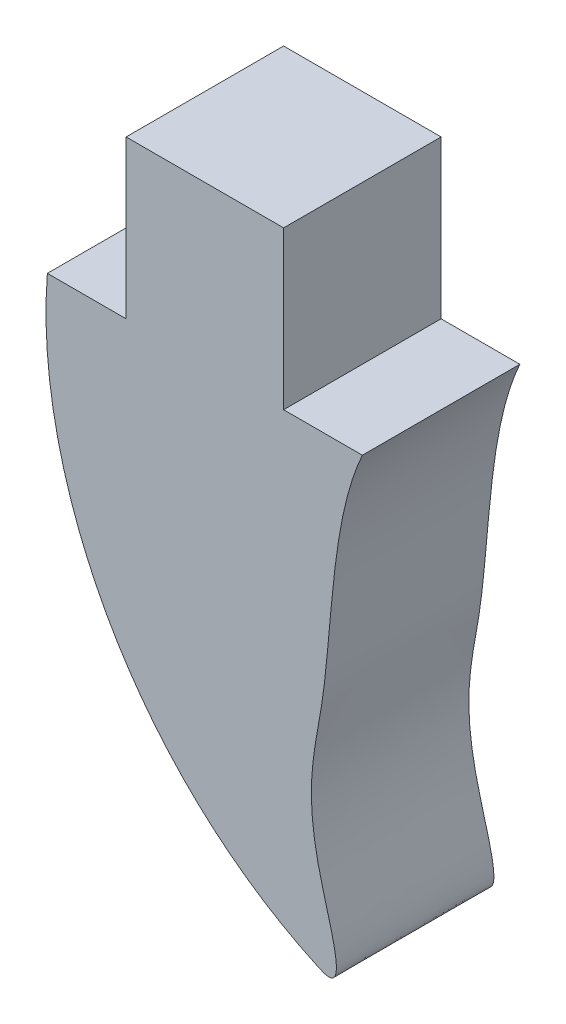
ISO-10303-21;
HEADER;
FILE_DESCRIPTION(('STEP AP214'),'2;1');
FILE_NAME('part.step','',(''),(''),'','','');
FILE_SCHEMA(('AUTOMOTIVE_DESIGN { 1 0 10303 214 1 1 1 1 }'));
ENDSEC;
DATA;
#1=APPLICATION_CONTEXT('core data for automotive mechanical design processes');
#2=APPLICATION_PROTOCOL_DEFINITION('international standard','automotive_design',2000,#1);
#3=PRODUCT_CONTEXT('',#1,'mechanical');
#4=PRODUCT('Part','Part','',(#3));
#5=PRODUCT_RELATED_PRODUCT_CATEGORY('part','',(#4));
#6=PRODUCT_DEFINITION_FORMATION('','',#4);
#7=PRODUCT_DEFINITION_CONTEXT('part definition',#1,'design');
#8=PRODUCT_DEFINITION('design','',#6,#7);
#9=PRODUCT_DEFINITION_SHAPE('','',#8);
#10=(LENGTH_UNIT() NAMED_UNIT(*) SI_UNIT(.MILLI.,.METRE.));
#11=(NAMED_UNIT(*) PLANE_ANGLE_UNIT() SI_UNIT($,.RADIAN.));
#12=(NAMED_UNIT(*) SI_UNIT($,.STERADIAN.) SOLID_ANGLE_UNIT());
#13=UNCERTAINTY_MEASURE_WITH_UNIT(LENGTH_MEASURE(1.E-05),#10,'distance_accuracy_value','');
#14=(GEOMETRIC_REPRESENTATION_CONTEXT(3) GLOBAL_UNCERTAINTY_ASSIGNED_CONTEXT((#13)) GLOBAL_UNIT_ASSIGNED_CONTEXT((#10,
#11,#12)) REPRESENTATION_CONTEXT('',''));
#15=CARTESIAN_POINT('',(0.,0.,0.));
#16=DIRECTION('',(0.,0.,1.));
#17=DIRECTION('',(1.,0.,0.));
#18=AXIS2_PLACEMENT_3D('',#15,#16,#17);
#19=CARTESIAN_POINT('',(0.,-1.5875,3.175));
#20=DIRECTION('',(0.,1.,0.));
#21=DIRECTION('',(0.,0.,1.));
#22=AXIS2_PLACEMENT_3D('',#19,#20,#21);
#23=PLANE('',#22);
#24=DIRECTION('',(1.,0.,0.));
#25=VECTOR('',#24,1.);
#26=CARTESIAN_POINT('',(0.,-1.5875,0.));
#27=LINE('',#26,#25);
#28=CARTESIAN_POINT('',(-3.175,-1.5875,0.));
#29=VERTEX_POINT('',#28);
#30=CARTESIAN_POINT('',(-1.5875,-1.5875,0.));
#31=VERTEX_POINT('',#30);
#32=EDGE_CURVE('E115',#29,#31,#27,.T.);
#33=ORIENTED_EDGE('',*,*,#32,.F.);
#34=DIRECTION('',(0.,0.,-1.));
#35=VECTOR('',#34,1.);
#36=CARTESIAN_POINT('',(-3.175,-1.5875,3.175));
#37=LINE('',#36,#35);
#38=CARTESIAN_POINT('',(-3.175,-1.5875,3.175));
#39=VERTEX_POINT('',#38);
#40=EDGE_CURVE('E11',#39,#29,#37,.T.);
#41=ORIENTED_EDGE('',*,*,#40,.F.);
#42=DIRECTION('',(1.,0.,0.));
#43=VECTOR('',#42,1.);
#44=CARTESIAN_POINT('',(0.,-1.5875,3.175));
#45=LINE('',#44,#43);
#46=CARTESIAN_POINT('',(-1.5875,-1.5875,3.175));
#47=VERTEX_POINT('',#46);
#48=EDGE_CURVE('E132',#39,#47,#45,.T.);
#49=ORIENTED_EDGE('',*,*,#48,.T.);
#50=DIRECTION('',(0.,0.,-1.));
#51=VECTOR('',#50,1.);
#52=CARTESIAN_POINT('',(-1.5875,-1.5875,3.175));
#53=LINE('',#52,#51);
#54=EDGE_CURVE('E51',#47,#31,#53,.T.);
#55=ORIENTED_EDGE('',*,*,#54,.T.);
#56=EDGE_LOOP('',(#33,#41,#49,#55));
#57=FACE_BOUND('',#56,.T.);
#58=ADVANCED_FACE('F33',(#57),#23,.T.);
#59=CARTESIAN_POINT('',(-3.175,-1.5875,3.175));
#60=CARTESIAN_POINT('',(-3.4658732282457,-5.27840353541545,3.175));
#61=CARTESIAN_POINT('',(-1.36488942947455,-9.32233801270144,3.175));
#62=CARTESIAN_POINT('',(2.93798962699941,-11.2634572011803,3.175));
#63=CARTESIAN_POINT('',(1.84536154852805,-8.32856897371346,3.175));
#64=CARTESIAN_POINT('',(2.60752198535033,-6.08333446419143,3.175));
#65=CARTESIAN_POINT('',(2.53133631888989,-3.00141900169966,3.175));
#66=CARTESIAN_POINT('',(3.175,-1.5875,3.175));
#67=B_SPLINE_CURVE_WITH_KNOTS('',3,(#59,#60,#61,#62,#63,#64,#65,#66),.UNSPECIFIED.,.F.,.F.,(4,1,
1,1,1,4),(0.,0.534256004928142,0.543775635905858,0.625264934896113,0.768463685116088,1.),.UNSPECIFIED.);
#68=DIRECTION('',(0.,0.,-1.));
#69=VECTOR('',#68,1.);
#70=SURFACE_OF_LINEAR_EXTRUSION('',#67,#69);
#71=CARTESIAN_POINT('',(-3.175,-1.5875,0.));
#72=CARTESIAN_POINT('',(-3.4658732282457,-5.27840353541545,0.));
#73=CARTESIAN_POINT('',(-1.36488942947455,-9.32233801270144,0.));
#74=CARTESIAN_POINT('',(2.93798962699941,-11.2634572011803,0.));
#75=CARTESIAN_POINT('',(1.84536154852805,-8.32856897371346,0.));
#76=CARTESIAN_POINT('',(2.60752198535033,-6.08333446419143,0.));
#77=CARTESIAN_POINT('',(2.53133631888989,-3.00141900169966,0.));
#78=CARTESIAN_POINT('',(3.175,-1.5875,0.));
#79=B_SPLINE_CURVE_WITH_KNOTS('',3,(#71,#72,#73,#74,#75,#76,#77,#78),.UNSPECIFIED.,.F.,.F.,(4,1,
1,1,1,4),(0.,0.534256004928142,0.543775635905858,0.625264934896113,0.768463685116088,1.),.UNSPECIFIED.);
#80=CARTESIAN_POINT('',(3.175,-1.5875,0.));
#81=VERTEX_POINT('',#80);
#82=EDGE_CURVE('E117',#29,#81,#79,.T.);
#83=ORIENTED_EDGE('',*,*,#82,.T.);
#84=DIRECTION('',(0.,0.,-1.));
#85=VECTOR('',#84,1.);
#86=CARTESIAN_POINT('',(3.175,-1.5875,3.175));
#87=LINE('',#86,#85);
#88=CARTESIAN_POINT('',(3.175,-1.5875,3.175));
#89=VERTEX_POINT('',#88);
#90=EDGE_CURVE('E43',#89,#81,#87,.T.);
#91=ORIENTED_EDGE('',*,*,#90,.F.);
#92=EDGE_CURVE('E218',#39,#89,#67,.T.);
#93=ORIENTED_EDGE('',*,*,#92,.F.);
#94=ORIENTED_EDGE('',*,*,#40,.T.);
#95=EDGE_LOOP('',(#83,#91,#93,#94));
#96=FACE_BOUND('',#95,.T.);
#97=ADVANCED_FACE('F35',(#96),#70,.F.);
#98=CARTESIAN_POINT('',(1.5875,-1.5875,0.));
#99=VERTEX_POINT('',#98);
#100=EDGE_CURVE('E118',#99,#81,#27,.T.);
#101=ORIENTED_EDGE('',*,*,#100,.F.);
#102=DIRECTION('',(0.,0.,-1.));
#103=VECTOR('',#102,1.);
#104=CARTESIAN_POINT('',(1.5875,-1.5875,3.175));
#105=LINE('',#104,#103);
#106=CARTESIAN_POINT('',(1.5875,-1.5875,3.175));
#107=VERTEX_POINT('',#106);
#108=EDGE_CURVE('E108',#107,#99,#105,.T.);
#109=ORIENTED_EDGE('',*,*,#108,.F.);
#110=EDGE_CURVE('E98',#107,#89,#45,.T.);
#111=ORIENTED_EDGE('',*,*,#110,.T.);
#112=ORIENTED_EDGE('',*,*,#90,.T.);
#113=EDGE_LOOP('',(#101,#109,#111,#112));
#114=FACE_BOUND('',#113,.T.);
#115=ADVANCED_FACE('F138',(#114),#23,.T.);
#116=CARTESIAN_POINT('',(1.5875,0.,3.175));
#117=DIRECTION('',(-1.,0.,0.));
#118=DIRECTION('',(0.,0.,1.));
#119=AXIS2_PLACEMENT_3D('',#116,#117,#118);
#120=PLANE('',#119);
#121=DIRECTION('',(0.,1.,0.));
#122=VECTOR('',#121,1.);
#123=CARTESIAN_POINT('',(1.5875,0.,0.));
#124=LINE('',#123,#122);
#125=CARTESIAN_POINT('',(1.5875,1.5875,0.));
#126=VERTEX_POINT('',#125);
#127=EDGE_CURVE('E105',#99,#126,#124,.T.);
#128=ORIENTED_EDGE('',*,*,#127,.T.);
#129=DIRECTION('',(0.,0.,-1.));
#130=VECTOR('',#129,1.);
#131=CARTESIAN_POINT('',(1.5875,1.5875,3.175));
#132=LINE('',#131,#130);
#133=CARTESIAN_POINT('',(1.5875,1.5875,3.175));
#134=VERTEX_POINT('',#133);
#135=EDGE_CURVE('E102',#134,#126,#132,.T.);
#136=ORIENTED_EDGE('',*,*,#135,.F.);
#137=DIRECTION('',(0.,1.,0.));
#138=VECTOR('',#137,1.);
#139=CARTESIAN_POINT('',(1.5875,0.,3.175));
#140=LINE('',#139,#138);
#141=EDGE_CURVE('E90',#107,#134,#140,.T.);
#142=ORIENTED_EDGE('',*,*,#141,.F.);
#143=ORIENTED_EDGE('',*,*,#108,.T.);
#144=EDGE_LOOP('',(#128,#136,#142,#143));
#145=FACE_BOUND('',#144,.T.);
#146=ADVANCED_FACE('F103',(#145),#120,.F.);
#147=CARTESIAN_POINT('',(0.,1.5875,3.175));
#148=DIRECTION('',(0.,-1.,0.));
#149=DIRECTION('',(1.,0.,0.));
#150=AXIS2_PLACEMENT_3D('',#147,#148,#149);
#151=PLANE('',#150);
#152=DIRECTION('',(-1.,0.,0.));
#153=VECTOR('',#152,1.);
#154=CARTESIAN_POINT('',(0.,1.5875,0.));
#155=LINE('',#154,#153);
#156=CARTESIAN_POINT('',(-1.5875,1.5875,0.));
#157=VERTEX_POINT('',#156);
#158=EDGE_CURVE('E127',#126,#157,#155,.T.);
#159=ORIENTED_EDGE('',*,*,#158,.T.);
#160=DIRECTION('',(0.,0.,-1.));
#161=VECTOR('',#160,1.);
#162=CARTESIAN_POINT('',(-1.5875,1.5875,3.175));
#163=LINE('',#162,#161);
#164=CARTESIAN_POINT('',(-1.5875,1.5875,3.175));
#165=VERTEX_POINT('',#164);
#166=EDGE_CURVE('E71',#165,#157,#163,.T.);
#167=ORIENTED_EDGE('',*,*,#166,.F.);
#168=DIRECTION('',(-1.,0.,0.));
#169=VECTOR('',#168,1.);
#170=CARTESIAN_POINT('',(0.,1.5875,3.175));
#171=LINE('',#170,#169);
#172=EDGE_CURVE('E96',#134,#165,#171,.T.);
#173=ORIENTED_EDGE('',*,*,#172,.F.);
#174=ORIENTED_EDGE('',*,*,#135,.T.);
#175=EDGE_LOOP('',(#159,#167,#173,#174));
#176=FACE_BOUND('',#175,.T.);
#177=ADVANCED_FACE('F110',(#176),#151,.F.);
#178=CARTESIAN_POINT('',(-1.5875,0.,3.175));
#179=DIRECTION('',(-1.,0.,0.));
#180=DIRECTION('',(0.,0.,1.));
#181=AXIS2_PLACEMENT_3D('',#178,#179,#180);
#182=PLANE('',#181);
#183=DIRECTION('',(0.,1.,0.));
#184=VECTOR('',#183,1.);
#185=CARTESIAN_POINT('',(-1.5875,0.,0.));
#186=LINE('',#185,#184);
#187=EDGE_CURVE('E129',#31,#157,#186,.T.);
#188=ORIENTED_EDGE('',*,*,#187,.F.);
#189=ORIENTED_EDGE('',*,*,#54,.F.);
#190=DIRECTION('',(0.,1.,0.));
#191=VECTOR('',#190,1.);
#192=CARTESIAN_POINT('',(-1.5875,0.,3.175));
#193=LINE('',#192,#191);
#194=EDGE_CURVE('E111',#47,#165,#193,.T.);
#195=ORIENTED_EDGE('',*,*,#194,.T.);
#196=ORIENTED_EDGE('',*,*,#166,.T.);
#197=EDGE_LOOP('',(#188,#189,#195,#196));
#198=FACE_BOUND('',#197,.T.);
#199=ADVANCED_FACE('F144',(#198),#182,.T.);
#200=CARTESIAN_POINT('',(0.,0.,3.175));
#201=DIRECTION('',(0.,0.,1.));
#202=DIRECTION('',(1.,0.,0.));
#203=AXIS2_PLACEMENT_3D('',#200,#201,#202);
#204=PLANE('',#203);
#205=ORIENTED_EDGE('',*,*,#48,.F.);
#206=ORIENTED_EDGE('',*,*,#92,.T.);
#207=ORIENTED_EDGE('',*,*,#110,.F.);
#208=ORIENTED_EDGE('',*,*,#141,.T.);
#209=ORIENTED_EDGE('',*,*,#172,.T.);
#210=ORIENTED_EDGE('',*,*,#194,.F.);
#211=EDGE_LOOP('',(#205,#206,#207,#208,#209,#210));
#212=FACE_BOUND('',#211,.T.);
#213=ADVANCED_FACE('F93',(#212),#204,.T.);
#214=CARTESIAN_POINT('',(0.,0.,0.));
#215=DIRECTION('',(0.,0.,1.));
#216=DIRECTION('',(1.,0.,0.));
#217=AXIS2_PLACEMENT_3D('',#214,#215,#216);
#218=PLANE('',#217);
#219=ORIENTED_EDGE('',*,*,#32,.T.);
#220=ORIENTED_EDGE('',*,*,#187,.T.);
#221=ORIENTED_EDGE('',*,*,#158,.F.);
#222=ORIENTED_EDGE('',*,*,#127,.F.);
#223=ORIENTED_EDGE('',*,*,#100,.T.);
#224=ORIENTED_EDGE('',*,*,#82,.F.);
#225=EDGE_LOOP('',(#219,#220,#221,#222,#223,#224));
#226=FACE_BOUND('',#225,.T.);
#227=ADVANCED_FACE('F143',(#226),#218,.F.);
#228=CLOSED_SHELL('',(#58,#97,#115,#146,#177,#199,#213,#227));
#229=MANIFOLD_SOLID_BREP('B2',#228);
#230=ADVANCED_BREP_SHAPE_REPRESENTATION('',(#18,#229),#14);
#231=SHAPE_DEFINITION_REPRESENTATION(#9,#230);
ENDSEC;
END-ISO-10303-21;
